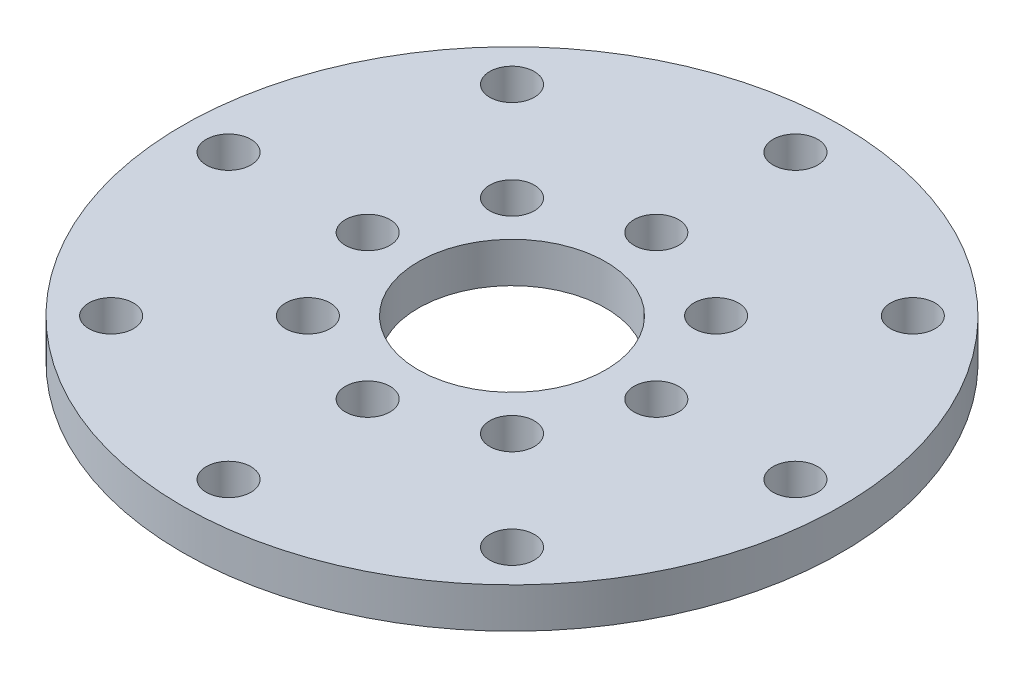
ISO-10303-21;
HEADER;
FILE_DESCRIPTION(('STEP AP214'),'2;1');
FILE_NAME('part.step','',(''),(''),'','','');
FILE_SCHEMA(('AUTOMOTIVE_DESIGN { 1 0 10303 214 1 1 1 1 }'));
ENDSEC;
DATA;
#1=APPLICATION_CONTEXT('core data for automotive mechanical design processes');
#2=APPLICATION_PROTOCOL_DEFINITION('international standard','automotive_design',2000,#1);
#3=PRODUCT_CONTEXT('',#1,'mechanical');
#4=PRODUCT('Part','Part','',(#3));
#5=PRODUCT_RELATED_PRODUCT_CATEGORY('part','',(#4));
#6=PRODUCT_DEFINITION_FORMATION('','',#4);
#7=PRODUCT_DEFINITION_CONTEXT('part definition',#1,'design');
#8=PRODUCT_DEFINITION('design','',#6,#7);
#9=PRODUCT_DEFINITION_SHAPE('','',#8);
#10=(LENGTH_UNIT() NAMED_UNIT(*) SI_UNIT(.MILLI.,.METRE.));
#11=(NAMED_UNIT(*) PLANE_ANGLE_UNIT() SI_UNIT($,.RADIAN.));
#12=(NAMED_UNIT(*) SI_UNIT($,.STERADIAN.) SOLID_ANGLE_UNIT());
#13=UNCERTAINTY_MEASURE_WITH_UNIT(LENGTH_MEASURE(1.E-05),#10,'distance_accuracy_value','');
#14=(GEOMETRIC_REPRESENTATION_CONTEXT(3) GLOBAL_UNCERTAINTY_ASSIGNED_CONTEXT((#13)) GLOBAL_UNIT_ASSIGNED_CONTEXT((#10,
#11,#12)) REPRESENTATION_CONTEXT('',''));
#15=CARTESIAN_POINT('',(0.,0.,0.));
#16=DIRECTION('',(0.,0.,1.));
#17=DIRECTION('',(1.,0.,0.));
#18=AXIS2_PLACEMENT_3D('',#15,#16,#17);
#19=CARTESIAN_POINT('',(0.,2.7,0.));
#20=DIRECTION('',(0.,1.,0.));
#21=DIRECTION('',(0.,0.,1.));
#22=AXIS2_PLACEMENT_3D('',#19,#20,#21);
#23=PLANE('',#22);
#24=CARTESIAN_POINT('',(-9.69999999999959,2.7,4.13535872212378E-13));
#25=DIRECTION('',(0.,1.,0.));
#26=DIRECTION('',(0.,0.,1.));
#27=AXIS2_PLACEMENT_3D('',#24,#25,#26);
#28=CIRCLE('',#27,1.50000000000061);
#29=CARTESIAN_POINT('',(-9.69999999999959,2.7,1.50000000000103));
#30=VERTEX_POINT('',#29);
#31=EDGE_CURVE('E131',#30,#30,#28,.T.);
#32=ORIENTED_EDGE('',*,*,#31,.F.);
#33=EDGE_LOOP('',(#32));
#34=FACE_BOUND('',#33,.T.);
#35=CARTESIAN_POINT('',(8.26220614899349E-13,2.7,9.7));
#36=DIRECTION('',(0.,1.,0.));
#37=DIRECTION('',(0.,0.,1.));
#38=AXIS2_PLACEMENT_3D('',#35,#36,#37);
#39=CIRCLE('',#38,1.50000000000086);
#40=CARTESIAN_POINT('',(8.26220614899349E-13,2.7,11.2000000000009));
#41=VERTEX_POINT('',#40);
#42=EDGE_CURVE('E119',#41,#41,#39,.T.);
#43=ORIENTED_EDGE('',*,*,#42,.F.);
#44=EDGE_LOOP('',(#43));
#45=FACE_BOUND('',#44,.T.);
#46=CARTESIAN_POINT('',(9.70000000000041,2.7,-4.12347964817205E-13));
#47=DIRECTION('',(0.,1.,0.));
#48=DIRECTION('',(0.,0.,1.));
#49=AXIS2_PLACEMENT_3D('',#46,#47,#48);
#50=CIRCLE('',#49,1.50000000000031);
#51=CARTESIAN_POINT('',(9.70000000000041,2.7,1.49999999999989));
#52=VERTEX_POINT('',#51);
#53=EDGE_CURVE('E107',#52,#52,#50,.T.);
#54=ORIENTED_EDGE('',*,*,#53,.F.);
#55=EDGE_LOOP('',(#54));
#56=FACE_BOUND('',#55,.T.);
#57=CARTESIAN_POINT('',(-13.4703841816035,2.7,-13.4703841816032));
#58=DIRECTION('',(0.,1.,0.));
#59=DIRECTION('',(0.,0.,1.));
#60=AXIS2_PLACEMENT_3D('',#57,#58,#59);
#61=CIRCLE('',#60,1.50000000000062);
#62=CARTESIAN_POINT('',(-13.4703841816035,2.7,-11.9703841816025));
#63=VERTEX_POINT('',#62);
#64=EDGE_CURVE('E95',#63,#63,#61,.T.);
#65=ORIENTED_EDGE('',*,*,#64,.F.);
#66=EDGE_LOOP('',(#65));
#67=FACE_BOUND('',#66,.T.);
#68=CARTESIAN_POINT('',(-13.4703841816024,2.7,13.4703841816043));
#69=DIRECTION('',(0.,1.,0.));
#70=DIRECTION('',(0.,0.,1.));
#71=AXIS2_PLACEMENT_3D('',#68,#69,#70);
#72=CIRCLE('',#71,1.50000000000165);
#73=CARTESIAN_POINT('',(-13.4703841816024,2.7,14.970384181606));
#74=VERTEX_POINT('',#73);
#75=EDGE_CURVE('E83',#74,#74,#72,.T.);
#76=ORIENTED_EDGE('',*,*,#75,.F.);
#77=EDGE_LOOP('',(#76));
#78=FACE_BOUND('',#77,.T.);
#79=CARTESIAN_POINT('',(13.4703841816051,2.7,13.4703841816032));
#80=DIRECTION('',(0.,1.,0.));
#81=DIRECTION('',(0.,0.,1.));
#82=AXIS2_PLACEMENT_3D('',#79,#80,#81);
#83=CIRCLE('',#82,1.50000000000125);
#84=CARTESIAN_POINT('',(13.4703841816051,2.7,14.9703841816044));
#85=VERTEX_POINT('',#84);
#86=EDGE_CURVE('E71',#85,#85,#83,.T.);
#87=ORIENTED_EDGE('',*,*,#86,.F.);
#88=EDGE_LOOP('',(#87));
#89=FACE_BOUND('',#88,.T.);
#90=CARTESIAN_POINT('',(13.470384181604,2.7,-13.4703841816043));
#91=DIRECTION('',(0.,1.,0.));
#92=DIRECTION('',(0.,0.,1.));
#93=AXIS2_PLACEMENT_3D('',#90,#91,#92);
#94=CIRCLE('',#93,1.50000000000009);
#95=CARTESIAN_POINT('',(13.470384181604,2.7,-11.9703841816042));
#96=VERTEX_POINT('',#95);
#97=EDGE_CURVE('E59',#96,#96,#94,.T.);
#98=ORIENTED_EDGE('',*,*,#97,.F.);
#99=EDGE_LOOP('',(#98));
#100=FACE_BOUND('',#99,.T.);
#101=CARTESIAN_POINT('',(0.,2.7,-19.05));
#102=DIRECTION('',(0.,1.,0.));
#103=DIRECTION('',(0.,0.,1.));
#104=AXIS2_PLACEMENT_3D('',#101,#102,#103);
#105=CIRCLE('',#104,1.5);
#106=CARTESIAN_POINT('',(0.,2.7,-17.55));
#107=VERTEX_POINT('',#106);
#108=EDGE_CURVE('E47',#107,#107,#105,.T.);
#109=ORIENTED_EDGE('',*,*,#108,.F.);
#110=EDGE_LOOP('',(#109));
#111=FACE_BOUND('',#110,.T.);
#112=CARTESIAN_POINT('',(0.,2.7,0.));
#113=DIRECTION('',(0.,1.,0.));
#114=DIRECTION('',(0.,0.,1.));
#115=AXIS2_PLACEMENT_3D('',#112,#113,#114);
#116=CIRCLE('',#115,22.15);
#117=CARTESIAN_POINT('',(0.,2.7,22.15));
#118=VERTEX_POINT('',#117);
#119=EDGE_CURVE('E10',#118,#118,#116,.T.);
#120=ORIENTED_EDGE('',*,*,#119,.T.);
#121=EDGE_LOOP('',(#120));
#122=FACE_BOUND('',#121,.T.);
#123=CARTESIAN_POINT('',(0.,2.7,0.));
#124=DIRECTION('',(0.,1.,0.));
#125=DIRECTION('',(0.,0.,1.));
#126=AXIS2_PLACEMENT_3D('',#123,#124,#125);
#127=CIRCLE('',#126,6.3);
#128=CARTESIAN_POINT('',(0.,2.7,6.3));
#129=VERTEX_POINT('',#128);
#130=EDGE_CURVE('E42',#129,#129,#127,.T.);
#131=ORIENTED_EDGE('',*,*,#130,.F.);
#132=EDGE_LOOP('',(#131));
#133=FACE_BOUND('',#132,.T.);
#134=CARTESIAN_POINT('',(0.,2.7,-9.7));
#135=DIRECTION('',(0.,1.,0.));
#136=DIRECTION('',(0.,0.,1.));
#137=AXIS2_PLACEMENT_3D('',#134,#135,#136);
#138=CIRCLE('',#137,1.5);
#139=CARTESIAN_POINT('',(0.,2.7,-8.2));
#140=VERTEX_POINT('',#139);
#141=EDGE_CURVE('E53',#140,#140,#138,.T.);
#142=ORIENTED_EDGE('',*,*,#141,.F.);
#143=EDGE_LOOP('',(#142));
#144=FACE_BOUND('',#143,.T.);
#145=CARTESIAN_POINT('',(19.0500000000008,2.7,-8.09817394821419E-13));
#146=DIRECTION('',(0.,1.,0.));
#147=DIRECTION('',(0.,0.,1.));
#148=AXIS2_PLACEMENT_3D('',#145,#146,#147);
#149=CIRCLE('',#148,1.5000000000006);
#150=CARTESIAN_POINT('',(19.0500000000008,2.7,1.49999999999979));
#151=VERTEX_POINT('',#150);
#152=EDGE_CURVE('E65',#151,#151,#149,.T.);
#153=ORIENTED_EDGE('',*,*,#152,.F.);
#154=EDGE_LOOP('',(#153));
#155=FACE_BOUND('',#154,.T.);
#156=CARTESIAN_POINT('',(1.62001443015057E-12,2.7,19.05));
#157=DIRECTION('',(0.,1.,0.));
#158=DIRECTION('',(0.,0.,1.));
#159=AXIS2_PLACEMENT_3D('',#156,#157,#158);
#160=CIRCLE('',#159,1.50000000000168);
#161=CARTESIAN_POINT('',(1.62001443015057E-12,2.7,20.5500000000017));
#162=VERTEX_POINT('',#161);
#163=EDGE_CURVE('E77',#162,#162,#160,.T.);
#164=ORIENTED_EDGE('',*,*,#163,.F.);
#165=EDGE_LOOP('',(#164));
#166=FACE_BOUND('',#165,.T.);
#167=CARTESIAN_POINT('',(-19.0499999999992,2.7,8.12150346973795E-13));
#168=DIRECTION('',(0.,1.,0.));
#169=DIRECTION('',(0.,0.,1.));
#170=AXIS2_PLACEMENT_3D('',#167,#168,#169);
#171=CIRCLE('',#170,1.50000000000121);
#172=CARTESIAN_POINT('',(-19.0499999999992,2.7,1.50000000000202));
#173=VERTEX_POINT('',#172);
#174=EDGE_CURVE('E89',#173,#173,#171,.T.);
#175=ORIENTED_EDGE('',*,*,#174,.F.);
#176=EDGE_LOOP('',(#175));
#177=FACE_BOUND('',#176,.T.);
#178=CARTESIAN_POINT('',(6.85893577750952,2.7,-6.8589357775095));
#179=DIRECTION('',(0.,1.,0.));
#180=DIRECTION('',(0.,0.,1.));
#181=AXIS2_PLACEMENT_3D('',#178,#179,#180);
#182=CIRCLE('',#181,1.5);
#183=CARTESIAN_POINT('',(6.85893577750952,2.7,-5.3589357775095));
#184=VERTEX_POINT('',#183);
#185=EDGE_CURVE('E101',#184,#184,#182,.T.);
#186=ORIENTED_EDGE('',*,*,#185,.F.);
#187=EDGE_LOOP('',(#186));
#188=FACE_BOUND('',#187,.T.);
#189=CARTESIAN_POINT('',(6.85893577751022,2.7,6.85893577750922));
#190=DIRECTION('',(0.,1.,0.));
#191=DIRECTION('',(0.,0.,1.));
#192=AXIS2_PLACEMENT_3D('',#189,#190,#191);
#193=CIRCLE('',#192,1.50000000000064);
#194=CARTESIAN_POINT('',(6.85893577751022,2.7,8.35893577750986));
#195=VERTEX_POINT('',#194);
#196=EDGE_CURVE('E113',#195,#195,#193,.T.);
#197=ORIENTED_EDGE('',*,*,#196,.F.);
#198=EDGE_LOOP('',(#197));
#199=FACE_BOUND('',#198,.T.);
#200=CARTESIAN_POINT('',(-6.8589357775088,2.7,6.8589357775098));
#201=DIRECTION('',(0.,1.,0.));
#202=DIRECTION('',(0.,0.,1.));
#203=AXIS2_PLACEMENT_3D('',#200,#201,#202);
#204=CIRCLE('',#203,1.50000000000084);
#205=CARTESIAN_POINT('',(-6.8589357775088,2.7,8.35893577751064));
#206=VERTEX_POINT('',#205);
#207=EDGE_CURVE('E125',#206,#206,#204,.T.);
#208=ORIENTED_EDGE('',*,*,#207,.F.);
#209=EDGE_LOOP('',(#208));
#210=FACE_BOUND('',#209,.T.);
#211=CARTESIAN_POINT('',(-6.85893577750943,2.7,-6.85893577750959));
#212=DIRECTION('',(0.,1.,0.));
#213=DIRECTION('',(0.,0.,1.));
#214=AXIS2_PLACEMENT_3D('',#211,#212,#213);
#215=CIRCLE('',#214,1.5);
#216=CARTESIAN_POINT('',(-6.85893577750943,2.7,-5.35893577750959));
#217=VERTEX_POINT('',#216);
#218=EDGE_CURVE('E137',#217,#217,#215,.T.);
#219=ORIENTED_EDGE('',*,*,#218,.F.);
#220=EDGE_LOOP('',(#219));
#221=FACE_BOUND('',#220,.T.);
#222=ADVANCED_FACE('F31',(#34,#45,#56,#67,#78,#89,#100,#111,#122,#133,#144,#155,#166,#177,#188,
#199,#210,#221),#23,.T.);
#223=CARTESIAN_POINT('',(0.,0.,0.));
#224=DIRECTION('',(0.,1.,0.));
#225=DIRECTION('',(0.,0.,1.));
#226=AXIS2_PLACEMENT_3D('',#223,#224,#225);
#227=PLANE('',#226);
#228=CARTESIAN_POINT('',(-9.69999999999959,0.,4.13535872212378E-13));
#229=DIRECTION('',(0.,1.,0.));
#230=DIRECTION('',(0.,0.,1.));
#231=AXIS2_PLACEMENT_3D('',#228,#229,#230);
#232=CIRCLE('',#231,1.50000000000061);
#233=CARTESIAN_POINT('',(-9.69999999999959,0.,1.50000000000103));
#234=VERTEX_POINT('',#233);
#235=EDGE_CURVE('E134',#234,#234,#232,.T.);
#236=ORIENTED_EDGE('',*,*,#235,.T.);
#237=EDGE_LOOP('',(#236));
#238=FACE_BOUND('',#237,.T.);
#239=CARTESIAN_POINT('',(8.26220614899349E-13,0.,9.7));
#240=DIRECTION('',(0.,1.,0.));
#241=DIRECTION('',(0.,0.,1.));
#242=AXIS2_PLACEMENT_3D('',#239,#240,#241);
#243=CIRCLE('',#242,1.50000000000086);
#244=CARTESIAN_POINT('',(8.26220614899349E-13,0.,11.2000000000009));
#245=VERTEX_POINT('',#244);
#246=EDGE_CURVE('E122',#245,#245,#243,.T.);
#247=ORIENTED_EDGE('',*,*,#246,.T.);
#248=EDGE_LOOP('',(#247));
#249=FACE_BOUND('',#248,.T.);
#250=CARTESIAN_POINT('',(9.70000000000041,0.,-4.12347964817205E-13));
#251=DIRECTION('',(0.,1.,0.));
#252=DIRECTION('',(0.,0.,1.));
#253=AXIS2_PLACEMENT_3D('',#250,#251,#252);
#254=CIRCLE('',#253,1.50000000000031);
#255=CARTESIAN_POINT('',(9.70000000000041,0.,1.49999999999989));
#256=VERTEX_POINT('',#255);
#257=EDGE_CURVE('E110',#256,#256,#254,.T.);
#258=ORIENTED_EDGE('',*,*,#257,.T.);
#259=EDGE_LOOP('',(#258));
#260=FACE_BOUND('',#259,.T.);
#261=CARTESIAN_POINT('',(-13.4703841816035,0.,-13.4703841816032));
#262=DIRECTION('',(0.,1.,0.));
#263=DIRECTION('',(0.,0.,1.));
#264=AXIS2_PLACEMENT_3D('',#261,#262,#263);
#265=CIRCLE('',#264,1.50000000000062);
#266=CARTESIAN_POINT('',(-13.4703841816035,0.,-11.9703841816025));
#267=VERTEX_POINT('',#266);
#268=EDGE_CURVE('E98',#267,#267,#265,.T.);
#269=ORIENTED_EDGE('',*,*,#268,.T.);
#270=EDGE_LOOP('',(#269));
#271=FACE_BOUND('',#270,.T.);
#272=CARTESIAN_POINT('',(-13.4703841816024,0.,13.4703841816043));
#273=DIRECTION('',(0.,1.,0.));
#274=DIRECTION('',(0.,0.,1.));
#275=AXIS2_PLACEMENT_3D('',#272,#273,#274);
#276=CIRCLE('',#275,1.50000000000165);
#277=CARTESIAN_POINT('',(-13.4703841816024,0.,14.970384181606));
#278=VERTEX_POINT('',#277);
#279=EDGE_CURVE('E86',#278,#278,#276,.T.);
#280=ORIENTED_EDGE('',*,*,#279,.T.);
#281=EDGE_LOOP('',(#280));
#282=FACE_BOUND('',#281,.T.);
#283=CARTESIAN_POINT('',(13.4703841816051,0.,13.4703841816032));
#284=DIRECTION('',(0.,1.,0.));
#285=DIRECTION('',(0.,0.,1.));
#286=AXIS2_PLACEMENT_3D('',#283,#284,#285);
#287=CIRCLE('',#286,1.50000000000125);
#288=CARTESIAN_POINT('',(13.4703841816051,0.,14.9703841816044));
#289=VERTEX_POINT('',#288);
#290=EDGE_CURVE('E74',#289,#289,#287,.T.);
#291=ORIENTED_EDGE('',*,*,#290,.T.);
#292=EDGE_LOOP('',(#291));
#293=FACE_BOUND('',#292,.T.);
#294=CARTESIAN_POINT('',(13.470384181604,0.,-13.4703841816043));
#295=DIRECTION('',(0.,1.,0.));
#296=DIRECTION('',(0.,0.,1.));
#297=AXIS2_PLACEMENT_3D('',#294,#295,#296);
#298=CIRCLE('',#297,1.50000000000009);
#299=CARTESIAN_POINT('',(13.470384181604,0.,-11.9703841816042));
#300=VERTEX_POINT('',#299);
#301=EDGE_CURVE('E62',#300,#300,#298,.T.);
#302=ORIENTED_EDGE('',*,*,#301,.T.);
#303=EDGE_LOOP('',(#302));
#304=FACE_BOUND('',#303,.T.);
#305=CARTESIAN_POINT('',(0.,0.,-19.05));
#306=DIRECTION('',(0.,1.,0.));
#307=DIRECTION('',(0.,0.,1.));
#308=AXIS2_PLACEMENT_3D('',#305,#306,#307);
#309=CIRCLE('',#308,1.5);
#310=CARTESIAN_POINT('',(0.,0.,-17.55));
#311=VERTEX_POINT('',#310);
#312=EDGE_CURVE('E50',#311,#311,#309,.T.);
#313=ORIENTED_EDGE('',*,*,#312,.T.);
#314=EDGE_LOOP('',(#313));
#315=FACE_BOUND('',#314,.T.);
#316=CARTESIAN_POINT('',(0.,0.,0.));
#317=DIRECTION('',(0.,1.,0.));
#318=DIRECTION('',(0.,0.,1.));
#319=AXIS2_PLACEMENT_3D('',#316,#317,#318);
#320=CIRCLE('',#319,22.15);
#321=CARTESIAN_POINT('',(0.,0.,22.15));
#322=VERTEX_POINT('',#321);
#323=EDGE_CURVE('E35',#322,#322,#320,.T.);
#324=ORIENTED_EDGE('',*,*,#323,.F.);
#325=EDGE_LOOP('',(#324));
#326=FACE_BOUND('',#325,.T.);
#327=CARTESIAN_POINT('',(0.,0.,0.));
#328=DIRECTION('',(0.,1.,0.));
#329=DIRECTION('',(0.,0.,1.));
#330=AXIS2_PLACEMENT_3D('',#327,#328,#329);
#331=CIRCLE('',#330,6.3);
#332=CARTESIAN_POINT('',(0.,0.,6.3));
#333=VERTEX_POINT('',#332);
#334=EDGE_CURVE('E44',#333,#333,#331,.T.);
#335=ORIENTED_EDGE('',*,*,#334,.T.);
#336=EDGE_LOOP('',(#335));
#337=FACE_BOUND('',#336,.T.);
#338=CARTESIAN_POINT('',(0.,0.,-9.7));
#339=DIRECTION('',(0.,1.,0.));
#340=DIRECTION('',(0.,0.,1.));
#341=AXIS2_PLACEMENT_3D('',#338,#339,#340);
#342=CIRCLE('',#341,1.5);
#343=CARTESIAN_POINT('',(0.,0.,-8.2));
#344=VERTEX_POINT('',#343);
#345=EDGE_CURVE('E56',#344,#344,#342,.T.);
#346=ORIENTED_EDGE('',*,*,#345,.T.);
#347=EDGE_LOOP('',(#346));
#348=FACE_BOUND('',#347,.T.);
#349=CARTESIAN_POINT('',(19.0500000000008,0.,-8.09817394821419E-13));
#350=DIRECTION('',(0.,1.,0.));
#351=DIRECTION('',(0.,0.,1.));
#352=AXIS2_PLACEMENT_3D('',#349,#350,#351);
#353=CIRCLE('',#352,1.5000000000006);
#354=CARTESIAN_POINT('',(19.0500000000008,0.,1.49999999999979));
#355=VERTEX_POINT('',#354);
#356=EDGE_CURVE('E68',#355,#355,#353,.T.);
#357=ORIENTED_EDGE('',*,*,#356,.T.);
#358=EDGE_LOOP('',(#357));
#359=FACE_BOUND('',#358,.T.);
#360=CARTESIAN_POINT('',(1.62001443015057E-12,0.,19.05));
#361=DIRECTION('',(0.,1.,0.));
#362=DIRECTION('',(0.,0.,1.));
#363=AXIS2_PLACEMENT_3D('',#360,#361,#362);
#364=CIRCLE('',#363,1.50000000000168);
#365=CARTESIAN_POINT('',(1.62001443015057E-12,0.,20.5500000000017));
#366=VERTEX_POINT('',#365);
#367=EDGE_CURVE('E80',#366,#366,#364,.T.);
#368=ORIENTED_EDGE('',*,*,#367,.T.);
#369=EDGE_LOOP('',(#368));
#370=FACE_BOUND('',#369,.T.);
#371=CARTESIAN_POINT('',(-19.0499999999992,0.,8.12150346973795E-13));
#372=DIRECTION('',(0.,1.,0.));
#373=DIRECTION('',(0.,0.,1.));
#374=AXIS2_PLACEMENT_3D('',#371,#372,#373);
#375=CIRCLE('',#374,1.50000000000121);
#376=CARTESIAN_POINT('',(-19.0499999999992,0.,1.50000000000202));
#377=VERTEX_POINT('',#376);
#378=EDGE_CURVE('E92',#377,#377,#375,.T.);
#379=ORIENTED_EDGE('',*,*,#378,.T.);
#380=EDGE_LOOP('',(#379));
#381=FACE_BOUND('',#380,.T.);
#382=CARTESIAN_POINT('',(6.85893577750952,0.,-6.8589357775095));
#383=DIRECTION('',(0.,1.,0.));
#384=DIRECTION('',(0.,0.,1.));
#385=AXIS2_PLACEMENT_3D('',#382,#383,#384);
#386=CIRCLE('',#385,1.5);
#387=CARTESIAN_POINT('',(6.85893577750952,0.,-5.3589357775095));
#388=VERTEX_POINT('',#387);
#389=EDGE_CURVE('E104',#388,#388,#386,.T.);
#390=ORIENTED_EDGE('',*,*,#389,.T.);
#391=EDGE_LOOP('',(#390));
#392=FACE_BOUND('',#391,.T.);
#393=CARTESIAN_POINT('',(6.85893577751022,0.,6.85893577750922));
#394=DIRECTION('',(0.,1.,0.));
#395=DIRECTION('',(0.,0.,1.));
#396=AXIS2_PLACEMENT_3D('',#393,#394,#395);
#397=CIRCLE('',#396,1.50000000000064);
#398=CARTESIAN_POINT('',(6.85893577751022,0.,8.35893577750986));
#399=VERTEX_POINT('',#398);
#400=EDGE_CURVE('E116',#399,#399,#397,.T.);
#401=ORIENTED_EDGE('',*,*,#400,.T.);
#402=EDGE_LOOP('',(#401));
#403=FACE_BOUND('',#402,.T.);
#404=CARTESIAN_POINT('',(-6.8589357775088,0.,6.8589357775098));
#405=DIRECTION('',(0.,1.,0.));
#406=DIRECTION('',(0.,0.,1.));
#407=AXIS2_PLACEMENT_3D('',#404,#405,#406);
#408=CIRCLE('',#407,1.50000000000084);
#409=CARTESIAN_POINT('',(-6.8589357775088,0.,8.35893577751064));
#410=VERTEX_POINT('',#409);
#411=EDGE_CURVE('E128',#410,#410,#408,.T.);
#412=ORIENTED_EDGE('',*,*,#411,.T.);
#413=EDGE_LOOP('',(#412));
#414=FACE_BOUND('',#413,.T.);
#415=CARTESIAN_POINT('',(-6.85893577750943,0.,-6.85893577750959));
#416=DIRECTION('',(0.,1.,0.));
#417=DIRECTION('',(0.,0.,1.));
#418=AXIS2_PLACEMENT_3D('',#415,#416,#417);
#419=CIRCLE('',#418,1.5);
#420=CARTESIAN_POINT('',(-6.85893577750943,0.,-5.35893577750959));
#421=VERTEX_POINT('',#420);
#422=EDGE_CURVE('E140',#421,#421,#419,.T.);
#423=ORIENTED_EDGE('',*,*,#422,.T.);
#424=EDGE_LOOP('',(#423));
#425=FACE_BOUND('',#424,.T.);
#426=ADVANCED_FACE('F150',(#238,#249,#260,#271,#282,#293,#304,#315,#326,#337,#348,#359,#370,
#381,#392,#403,#414,#425),#227,.F.);
#427=CARTESIAN_POINT('',(0.,2.7,0.));
#428=DIRECTION('',(0.,-1.,0.));
#429=DIRECTION('',(0.,0.,-1.));
#430=AXIS2_PLACEMENT_3D('',#427,#428,#429);
#431=CYLINDRICAL_SURFACE('',#430,22.15);
#432=ORIENTED_EDGE('',*,*,#119,.F.);
#433=EDGE_LOOP('',(#432));
#434=FACE_BOUND('',#433,.T.);
#435=ORIENTED_EDGE('',*,*,#323,.T.);
#436=EDGE_LOOP('',(#435));
#437=FACE_BOUND('',#436,.T.);
#438=ADVANCED_FACE('F33',(#434,#437),#431,.T.);
#439=CARTESIAN_POINT('',(0.,2.7,0.));
#440=DIRECTION('',(0.,-1.,0.));
#441=DIRECTION('',(0.,0.,-1.));
#442=AXIS2_PLACEMENT_3D('',#439,#440,#441);
#443=CYLINDRICAL_SURFACE('',#442,6.3);
#444=ORIENTED_EDGE('',*,*,#130,.T.);
#445=EDGE_LOOP('',(#444));
#446=FACE_BOUND('',#445,.T.);
#447=ORIENTED_EDGE('',*,*,#334,.F.);
#448=EDGE_LOOP('',(#447));
#449=FACE_BOUND('',#448,.T.);
#450=ADVANCED_FACE('F160',(#446,#449),#443,.F.);
#451=CARTESIAN_POINT('',(0.,2.7,-19.05));
#452=DIRECTION('',(0.,-1.,0.));
#453=DIRECTION('',(0.,0.,-1.));
#454=AXIS2_PLACEMENT_3D('',#451,#452,#453);
#455=CYLINDRICAL_SURFACE('',#454,1.5);
#456=ORIENTED_EDGE('',*,*,#108,.T.);
#457=EDGE_LOOP('',(#456));
#458=FACE_BOUND('',#457,.T.);
#459=ORIENTED_EDGE('',*,*,#312,.F.);
#460=EDGE_LOOP('',(#459));
#461=FACE_BOUND('',#460,.T.);
#462=ADVANCED_FACE('F163',(#458,#461),#455,.F.);
#463=CARTESIAN_POINT('',(0.,2.7,-9.7));
#464=DIRECTION('',(0.,-1.,0.));
#465=DIRECTION('',(0.,0.,-1.));
#466=AXIS2_PLACEMENT_3D('',#463,#464,#465);
#467=CYLINDRICAL_SURFACE('',#466,1.5);
#468=ORIENTED_EDGE('',*,*,#141,.T.);
#469=EDGE_LOOP('',(#468));
#470=FACE_BOUND('',#469,.T.);
#471=ORIENTED_EDGE('',*,*,#345,.F.);
#472=EDGE_LOOP('',(#471));
#473=FACE_BOUND('',#472,.T.);
#474=ADVANCED_FACE('F167',(#470,#473),#467,.F.);
#475=CARTESIAN_POINT('',(13.470384181604,2.7,-13.4703841816043));
#476=DIRECTION('',(0.,-1.,0.));
#477=DIRECTION('',(0.,0.,-1.));
#478=AXIS2_PLACEMENT_3D('',#475,#476,#477);
#479=CYLINDRICAL_SURFACE('',#478,1.50000000000009);
#480=ORIENTED_EDGE('',*,*,#97,.T.);
#481=EDGE_LOOP('',(#480));
#482=FACE_BOUND('',#481,.T.);
#483=ORIENTED_EDGE('',*,*,#301,.F.);
#484=EDGE_LOOP('',(#483));
#485=FACE_BOUND('',#484,.T.);
#486=ADVANCED_FACE('F171',(#482,#485),#479,.F.);
#487=CARTESIAN_POINT('',(19.0500000000008,2.7,-8.09817394821419E-13));
#488=DIRECTION('',(0.,-1.,0.));
#489=DIRECTION('',(0.,0.,-1.));
#490=AXIS2_PLACEMENT_3D('',#487,#488,#489);
#491=CYLINDRICAL_SURFACE('',#490,1.5000000000006);
#492=ORIENTED_EDGE('',*,*,#152,.T.);
#493=EDGE_LOOP('',(#492));
#494=FACE_BOUND('',#493,.T.);
#495=ORIENTED_EDGE('',*,*,#356,.F.);
#496=EDGE_LOOP('',(#495));
#497=FACE_BOUND('',#496,.T.);
#498=ADVANCED_FACE('F175',(#494,#497),#491,.F.);
#499=CARTESIAN_POINT('',(13.4703841816051,2.7,13.4703841816032));
#500=DIRECTION('',(0.,-1.,0.));
#501=DIRECTION('',(0.,0.,-1.));
#502=AXIS2_PLACEMENT_3D('',#499,#500,#501);
#503=CYLINDRICAL_SURFACE('',#502,1.50000000000125);
#504=ORIENTED_EDGE('',*,*,#86,.T.);
#505=EDGE_LOOP('',(#504));
#506=FACE_BOUND('',#505,.T.);
#507=ORIENTED_EDGE('',*,*,#290,.F.);
#508=EDGE_LOOP('',(#507));
#509=FACE_BOUND('',#508,.T.);
#510=ADVANCED_FACE('F179',(#506,#509),#503,.F.);
#511=CARTESIAN_POINT('',(1.62001443015057E-12,2.7,19.05));
#512=DIRECTION('',(0.,-1.,0.));
#513=DIRECTION('',(0.,0.,-1.));
#514=AXIS2_PLACEMENT_3D('',#511,#512,#513);
#515=CYLINDRICAL_SURFACE('',#514,1.50000000000168);
#516=ORIENTED_EDGE('',*,*,#163,.T.);
#517=EDGE_LOOP('',(#516));
#518=FACE_BOUND('',#517,.T.);
#519=ORIENTED_EDGE('',*,*,#367,.F.);
#520=EDGE_LOOP('',(#519));
#521=FACE_BOUND('',#520,.T.);
#522=ADVANCED_FACE('F183',(#518,#521),#515,.F.);
#523=CARTESIAN_POINT('',(-13.4703841816024,2.7,13.4703841816043));
#524=DIRECTION('',(0.,-1.,0.));
#525=DIRECTION('',(0.,0.,-1.));
#526=AXIS2_PLACEMENT_3D('',#523,#524,#525);
#527=CYLINDRICAL_SURFACE('',#526,1.50000000000165);
#528=ORIENTED_EDGE('',*,*,#75,.T.);
#529=EDGE_LOOP('',(#528));
#530=FACE_BOUND('',#529,.T.);
#531=ORIENTED_EDGE('',*,*,#279,.F.);
#532=EDGE_LOOP('',(#531));
#533=FACE_BOUND('',#532,.T.);
#534=ADVANCED_FACE('F187',(#530,#533),#527,.F.);
#535=CARTESIAN_POINT('',(-19.0499999999992,2.7,8.12150346973795E-13));
#536=DIRECTION('',(0.,-1.,0.));
#537=DIRECTION('',(0.,0.,-1.));
#538=AXIS2_PLACEMENT_3D('',#535,#536,#537);
#539=CYLINDRICAL_SURFACE('',#538,1.50000000000121);
#540=ORIENTED_EDGE('',*,*,#174,.T.);
#541=EDGE_LOOP('',(#540));
#542=FACE_BOUND('',#541,.T.);
#543=ORIENTED_EDGE('',*,*,#378,.F.);
#544=EDGE_LOOP('',(#543));
#545=FACE_BOUND('',#544,.T.);
#546=ADVANCED_FACE('F191',(#542,#545),#539,.F.);
#547=CARTESIAN_POINT('',(-13.4703841816035,2.7,-13.4703841816032));
#548=DIRECTION('',(0.,-1.,0.));
#549=DIRECTION('',(0.,0.,-1.));
#550=AXIS2_PLACEMENT_3D('',#547,#548,#549);
#551=CYLINDRICAL_SURFACE('',#550,1.50000000000062);
#552=ORIENTED_EDGE('',*,*,#64,.T.);
#553=EDGE_LOOP('',(#552));
#554=FACE_BOUND('',#553,.T.);
#555=ORIENTED_EDGE('',*,*,#268,.F.);
#556=EDGE_LOOP('',(#555));
#557=FACE_BOUND('',#556,.T.);
#558=ADVANCED_FACE('F195',(#554,#557),#551,.F.);
#559=CARTESIAN_POINT('',(6.85893577750952,2.7,-6.8589357775095));
#560=DIRECTION('',(0.,-1.,0.));
#561=DIRECTION('',(0.,0.,-1.));
#562=AXIS2_PLACEMENT_3D('',#559,#560,#561);
#563=CYLINDRICAL_SURFACE('',#562,1.5);
#564=ORIENTED_EDGE('',*,*,#185,.T.);
#565=EDGE_LOOP('',(#564));
#566=FACE_BOUND('',#565,.T.);
#567=ORIENTED_EDGE('',*,*,#389,.F.);
#568=EDGE_LOOP('',(#567));
#569=FACE_BOUND('',#568,.T.);
#570=ADVANCED_FACE('F199',(#566,#569),#563,.F.);
#571=CARTESIAN_POINT('',(9.70000000000041,2.7,-4.12347964817205E-13));
#572=DIRECTION('',(0.,-1.,0.));
#573=DIRECTION('',(0.,0.,-1.));
#574=AXIS2_PLACEMENT_3D('',#571,#572,#573);
#575=CYLINDRICAL_SURFACE('',#574,1.50000000000031);
#576=ORIENTED_EDGE('',*,*,#53,.T.);
#577=EDGE_LOOP('',(#576));
#578=FACE_BOUND('',#577,.T.);
#579=ORIENTED_EDGE('',*,*,#257,.F.);
#580=EDGE_LOOP('',(#579));
#581=FACE_BOUND('',#580,.T.);
#582=ADVANCED_FACE('F203',(#578,#581),#575,.F.);
#583=CARTESIAN_POINT('',(6.85893577751022,2.7,6.85893577750922));
#584=DIRECTION('',(0.,-1.,0.));
#585=DIRECTION('',(0.,0.,-1.));
#586=AXIS2_PLACEMENT_3D('',#583,#584,#585);
#587=CYLINDRICAL_SURFACE('',#586,1.50000000000064);
#588=ORIENTED_EDGE('',*,*,#196,.T.);
#589=EDGE_LOOP('',(#588));
#590=FACE_BOUND('',#589,.T.);
#591=ORIENTED_EDGE('',*,*,#400,.F.);
#592=EDGE_LOOP('',(#591));
#593=FACE_BOUND('',#592,.T.);
#594=ADVANCED_FACE('F207',(#590,#593),#587,.F.);
#595=CARTESIAN_POINT('',(8.26220614899349E-13,2.7,9.7));
#596=DIRECTION('',(0.,-1.,0.));
#597=DIRECTION('',(0.,0.,-1.));
#598=AXIS2_PLACEMENT_3D('',#595,#596,#597);
#599=CYLINDRICAL_SURFACE('',#598,1.50000000000086);
#600=ORIENTED_EDGE('',*,*,#42,.T.);
#601=EDGE_LOOP('',(#600));
#602=FACE_BOUND('',#601,.T.);
#603=ORIENTED_EDGE('',*,*,#246,.F.);
#604=EDGE_LOOP('',(#603));
#605=FACE_BOUND('',#604,.T.);
#606=ADVANCED_FACE('F211',(#602,#605),#599,.F.);
#607=CARTESIAN_POINT('',(-6.8589357775088,2.7,6.8589357775098));
#608=DIRECTION('',(0.,-1.,0.));
#609=DIRECTION('',(0.,0.,-1.));
#610=AXIS2_PLACEMENT_3D('',#607,#608,#609);
#611=CYLINDRICAL_SURFACE('',#610,1.50000000000084);
#612=ORIENTED_EDGE('',*,*,#207,.T.);
#613=EDGE_LOOP('',(#612));
#614=FACE_BOUND('',#613,.T.);
#615=ORIENTED_EDGE('',*,*,#411,.F.);
#616=EDGE_LOOP('',(#615));
#617=FACE_BOUND('',#616,.T.);
#618=ADVANCED_FACE('F215',(#614,#617),#611,.F.);
#619=CARTESIAN_POINT('',(-9.69999999999959,2.7,4.13535872212378E-13));
#620=DIRECTION('',(0.,-1.,0.));
#621=DIRECTION('',(0.,0.,-1.));
#622=AXIS2_PLACEMENT_3D('',#619,#620,#621);
#623=CYLINDRICAL_SURFACE('',#622,1.50000000000061);
#624=ORIENTED_EDGE('',*,*,#31,.T.);
#625=EDGE_LOOP('',(#624));
#626=FACE_BOUND('',#625,.T.);
#627=ORIENTED_EDGE('',*,*,#235,.F.);
#628=EDGE_LOOP('',(#627));
#629=FACE_BOUND('',#628,.T.);
#630=ADVANCED_FACE('F219',(#626,#629),#623,.F.);
#631=CARTESIAN_POINT('',(-6.85893577750943,2.7,-6.85893577750959));
#632=DIRECTION('',(0.,-1.,0.));
#633=DIRECTION('',(0.,0.,-1.));
#634=AXIS2_PLACEMENT_3D('',#631,#632,#633);
#635=CYLINDRICAL_SURFACE('',#634,1.5);
#636=ORIENTED_EDGE('',*,*,#218,.T.);
#637=EDGE_LOOP('',(#636));
#638=FACE_BOUND('',#637,.T.);
#639=ORIENTED_EDGE('',*,*,#422,.F.);
#640=EDGE_LOOP('',(#639));
#641=FACE_BOUND('',#640,.T.);
#642=ADVANCED_FACE('F146',(#638,#641),#635,.F.);
#643=CLOSED_SHELL('',(#222,#426,#438,#450,#462,#474,#486,#498,#510,#522,#534,#546,#558,#570,
#582,#594,#606,#618,#630,#642));
#644=MANIFOLD_SOLID_BREP('B2',#643);
#645=ADVANCED_BREP_SHAPE_REPRESENTATION('',(#18,#644),#14);
#646=SHAPE_DEFINITION_REPRESENTATION(#9,#645);
ENDSEC;
END-ISO-10303-21;
